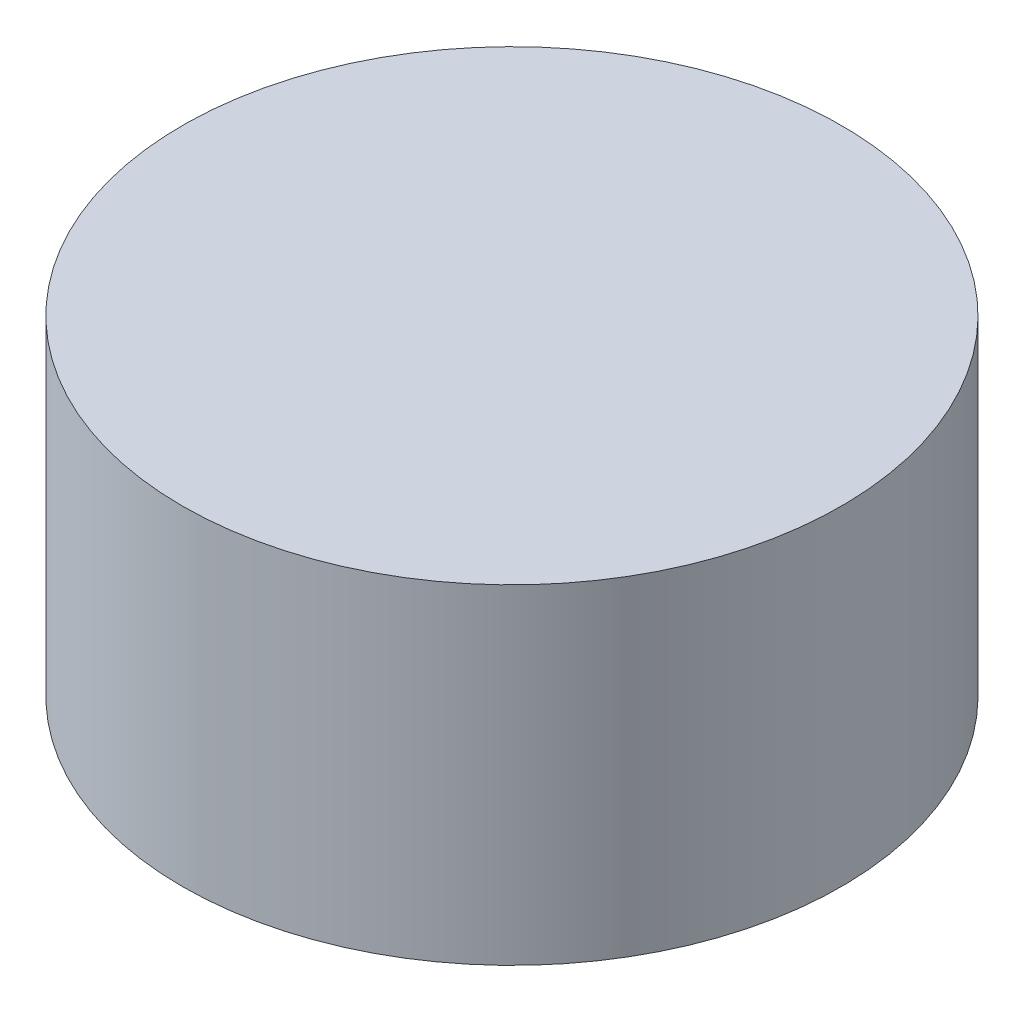
ISO-10303-21;
HEADER;
FILE_DESCRIPTION(('STEP AP214'),'2;1');
FILE_NAME('part.step','',(''),(''),'','','');
FILE_SCHEMA(('AUTOMOTIVE_DESIGN { 1 0 10303 214 1 1 1 1 }'));
ENDSEC;
DATA;
#1=APPLICATION_CONTEXT('core data for automotive mechanical design processes');
#2=APPLICATION_PROTOCOL_DEFINITION('international standard','automotive_design',2000,#1);
#3=PRODUCT_CONTEXT('',#1,'mechanical');
#4=PRODUCT('Part','Part','',(#3));
#5=PRODUCT_RELATED_PRODUCT_CATEGORY('part','',(#4));
#6=PRODUCT_DEFINITION_FORMATION('','',#4);
#7=PRODUCT_DEFINITION_CONTEXT('part definition',#1,'design');
#8=PRODUCT_DEFINITION('design','',#6,#7);
#9=PRODUCT_DEFINITION_SHAPE('','',#8);
#10=(LENGTH_UNIT() NAMED_UNIT(*) SI_UNIT(.MILLI.,.METRE.));
#11=(NAMED_UNIT(*) PLANE_ANGLE_UNIT() SI_UNIT($,.RADIAN.));
#12=(NAMED_UNIT(*) SI_UNIT($,.STERADIAN.) SOLID_ANGLE_UNIT());
#13=UNCERTAINTY_MEASURE_WITH_UNIT(LENGTH_MEASURE(1.E-05),#10,'distance_accuracy_value','');
#14=(GEOMETRIC_REPRESENTATION_CONTEXT(3) GLOBAL_UNCERTAINTY_ASSIGNED_CONTEXT((#13)) GLOBAL_UNIT_ASSIGNED_CONTEXT((#10,
#11,#12)) REPRESENTATION_CONTEXT('',''));
#15=CARTESIAN_POINT('',(0.,0.,0.));
#16=DIRECTION('',(0.,0.,1.));
#17=DIRECTION('',(1.,0.,0.));
#18=AXIS2_PLACEMENT_3D('',#15,#16,#17);
#19=CARTESIAN_POINT('',(0.,3.,0.));
#20=DIRECTION('',(0.,-1.,0.));
#21=DIRECTION('',(0.,0.,-1.));
#22=AXIS2_PLACEMENT_3D('',#19,#20,#21);
#23=CYLINDRICAL_SURFACE('',#22,3.);
#24=CARTESIAN_POINT('',(0.,3.,0.));
#25=DIRECTION('',(0.,1.,0.));
#26=DIRECTION('',(0.,0.,1.));
#27=AXIS2_PLACEMENT_3D('',#24,#25,#26);
#28=CIRCLE('',#27,3.);
#29=CARTESIAN_POINT('',(0.,3.,3.));
#30=VERTEX_POINT('',#29);
#31=EDGE_CURVE('E10',#30,#30,#28,.T.);
#32=ORIENTED_EDGE('',*,*,#31,.F.);
#33=EDGE_LOOP('',(#32));
#34=FACE_BOUND('',#33,.T.);
#35=CARTESIAN_POINT('',(0.,0.,0.));
#36=DIRECTION('',(0.,1.,0.));
#37=DIRECTION('',(0.,0.,1.));
#38=AXIS2_PLACEMENT_3D('',#35,#36,#37);
#39=CIRCLE('',#38,3.);
#40=CARTESIAN_POINT('',(0.,0.,3.));
#41=VERTEX_POINT('',#40);
#42=EDGE_CURVE('E40',#41,#41,#39,.T.);
#43=ORIENTED_EDGE('',*,*,#42,.T.);
#44=EDGE_LOOP('',(#43));
#45=FACE_BOUND('',#44,.T.);
#46=ADVANCED_FACE('F37',(#34,#45),#23,.T.);
#47=CARTESIAN_POINT('',(0.,3.,0.));
#48=DIRECTION('',(0.,1.,0.));
#49=DIRECTION('',(0.,0.,1.));
#50=AXIS2_PLACEMENT_3D('',#47,#48,#49);
#51=PLANE('',#50);
#52=ORIENTED_EDGE('',*,*,#31,.T.);
#53=EDGE_LOOP('',(#52));
#54=FACE_BOUND('',#53,.T.);
#55=ADVANCED_FACE('F54',(#54),#51,.T.);
#56=CARTESIAN_POINT('',(0.,0.,0.));
#57=DIRECTION('',(0.,1.,0.));
#58=DIRECTION('',(0.,0.,1.));
#59=AXIS2_PLACEMENT_3D('',#56,#57,#58);
#60=PLANE('',#59);
#61=ORIENTED_EDGE('',*,*,#42,.F.);
#62=EDGE_LOOP('',(#61));
#63=FACE_BOUND('',#62,.T.);
#64=ADVANCED_FACE('F52',(#63),#60,.F.);
#65=CLOSED_SHELL('',(#46,#55,#64));
#66=MANIFOLD_SOLID_BREP('B2',#65);
#67=ADVANCED_BREP_SHAPE_REPRESENTATION('',(#18,#66),#14);
#68=SHAPE_DEFINITION_REPRESENTATION(#9,#67);
ENDSEC;
END-ISO-10303-21;
